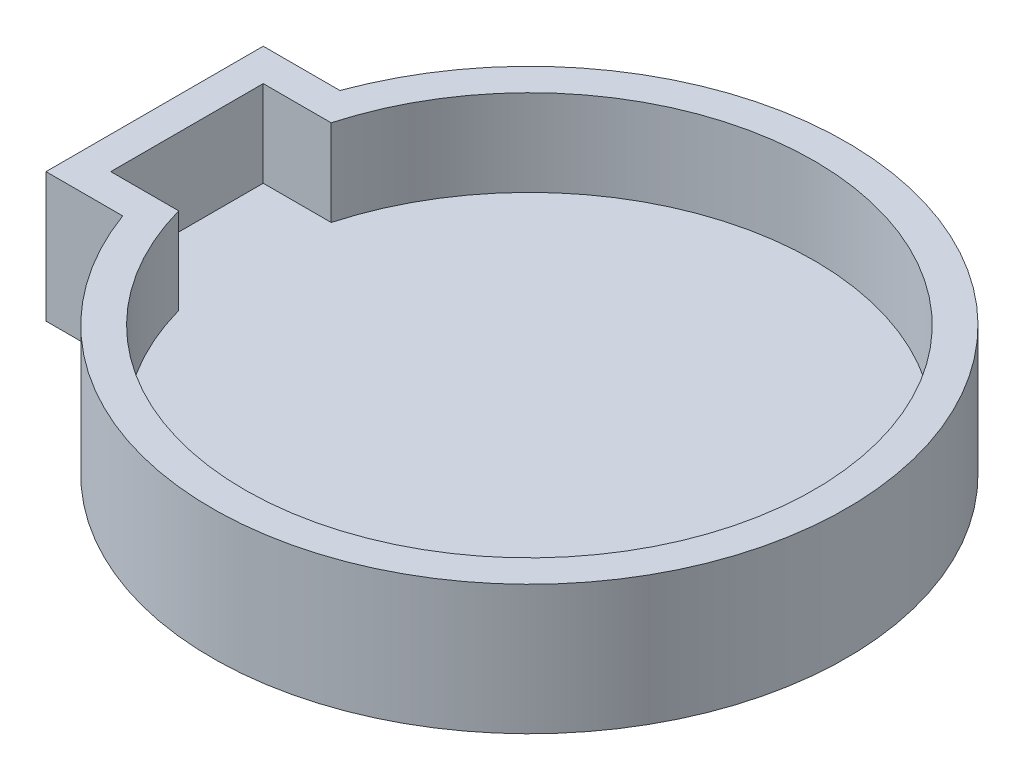
ISO-10303-21;
HEADER;
FILE_DESCRIPTION(('STEP AP214'),'2;1');
FILE_NAME('part.step','',(''),(''),'','','');
FILE_SCHEMA(('AUTOMOTIVE_DESIGN { 1 0 10303 214 1 1 1 1 }'));
ENDSEC;
DATA;
#1=APPLICATION_CONTEXT('core data for automotive mechanical design processes');
#2=APPLICATION_PROTOCOL_DEFINITION('international standard','automotive_design',2000,#1);
#3=PRODUCT_CONTEXT('',#1,'mechanical');
#4=PRODUCT('Part','Part','',(#3));
#5=PRODUCT_RELATED_PRODUCT_CATEGORY('part','',(#4));
#6=PRODUCT_DEFINITION_FORMATION('','',#4);
#7=PRODUCT_DEFINITION_CONTEXT('part definition',#1,'design');
#8=PRODUCT_DEFINITION('design','',#6,#7);
#9=PRODUCT_DEFINITION_SHAPE('','',#8);
#10=(LENGTH_UNIT() NAMED_UNIT(*) SI_UNIT(.MILLI.,.METRE.));
#11=(NAMED_UNIT(*) PLANE_ANGLE_UNIT() SI_UNIT($,.RADIAN.));
#12=(NAMED_UNIT(*) SI_UNIT($,.STERADIAN.) SOLID_ANGLE_UNIT());
#13=UNCERTAINTY_MEASURE_WITH_UNIT(LENGTH_MEASURE(1.E-05),#10,'distance_accuracy_value','');
#14=(GEOMETRIC_REPRESENTATION_CONTEXT(3) GLOBAL_UNCERTAINTY_ASSIGNED_CONTEXT((#13)) GLOBAL_UNIT_ASSIGNED_CONTEXT((#10,
#11,#12)) REPRESENTATION_CONTEXT('',''));
#15=CARTESIAN_POINT('',(0.,0.,0.));
#16=DIRECTION('',(0.,0.,1.));
#17=DIRECTION('',(1.,0.,0.));
#18=AXIS2_PLACEMENT_3D('',#15,#16,#17);
#19=CARTESIAN_POINT('',(-26.05,3.,-7.55));
#20=DIRECTION('',(1.,0.,0.));
#21=DIRECTION('',(0.,0.,-1.));
#22=AXIS2_PLACEMENT_3D('',#19,#20,#21);
#23=PLANE('',#22);
#24=DIRECTION('',(0.,0.,1.));
#25=VECTOR('',#24,1.);
#26=CARTESIAN_POINT('',(-26.05,0.,-7.55));
#27=LINE('',#26,#25);
#28=CARTESIAN_POINT('',(-26.05,0.,-7.55));
#29=VERTEX_POINT('',#28);
#30=CARTESIAN_POINT('',(-26.05,0.,7.55));
#31=VERTEX_POINT('',#30);
#32=EDGE_CURVE('E171',#29,#31,#27,.T.);
#33=ORIENTED_EDGE('',*,*,#32,.T.);
#34=DIRECTION('',(0.,-1.,0.));
#35=VECTOR('',#34,1.);
#36=CARTESIAN_POINT('',(-26.05,3.,7.55));
#37=LINE('',#36,#35);
#38=CARTESIAN_POINT('',(-26.05,9.,7.55));
#39=VERTEX_POINT('',#38);
#40=EDGE_CURVE('E11',#39,#31,#37,.T.);
#41=ORIENTED_EDGE('',*,*,#40,.F.);
#42=DIRECTION('',(0.,0.,1.));
#43=VECTOR('',#42,1.);
#44=CARTESIAN_POINT('',(-26.05,9.,-7.55));
#45=LINE('',#44,#43);
#46=CARTESIAN_POINT('',(-26.05,9.,-7.55));
#47=VERTEX_POINT('',#46);
#48=EDGE_CURVE('E159',#47,#39,#45,.T.);
#49=ORIENTED_EDGE('',*,*,#48,.F.);
#50=DIRECTION('',(0.,-1.,0.));
#51=VECTOR('',#50,1.);
#52=CARTESIAN_POINT('',(-26.05,3.,-7.55));
#53=LINE('',#52,#51);
#54=EDGE_CURVE('E184',#47,#29,#53,.T.);
#55=ORIENTED_EDGE('',*,*,#54,.T.);
#56=EDGE_LOOP('',(#33,#41,#49,#55));
#57=FACE_BOUND('',#56,.T.);
#58=ADVANCED_FACE('F43',(#57),#23,.F.);
#59=CARTESIAN_POINT('',(-26.05,3.,7.55));
#60=DIRECTION('',(0.,0.,-1.));
#61=DIRECTION('',(-1.,0.,0.));
#62=AXIS2_PLACEMENT_3D('',#59,#60,#61);
#63=PLANE('',#62);
#64=DIRECTION('',(1.,0.,0.));
#65=VECTOR('',#64,1.);
#66=CARTESIAN_POINT('',(-26.05,0.,7.55));
#67=LINE('',#66,#65);
#68=CARTESIAN_POINT('',(-20.7171426601257,0.,7.54999999999999));
#69=VERTEX_POINT('',#68);
#70=EDGE_CURVE('E175',#31,#69,#67,.T.);
#71=ORIENTED_EDGE('',*,*,#70,.T.);
#72=DIRECTION('',(0.,-1.,0.));
#73=VECTOR('',#72,1.);
#74=CARTESIAN_POINT('',(-20.7171426601257,3.,7.54999999999999));
#75=LINE('',#74,#73);
#76=CARTESIAN_POINT('',(-20.7171426601257,9.,7.54999999999999));
#77=VERTEX_POINT('',#76);
#78=EDGE_CURVE('E51',#77,#69,#75,.T.);
#79=ORIENTED_EDGE('',*,*,#78,.F.);
#80=DIRECTION('',(1.,0.,0.));
#81=VECTOR('',#80,1.);
#82=CARTESIAN_POINT('',(-26.05,9.,7.55));
#83=LINE('',#82,#81);
#84=EDGE_CURVE('E163',#39,#77,#83,.T.);
#85=ORIENTED_EDGE('',*,*,#84,.F.);
#86=ORIENTED_EDGE('',*,*,#40,.T.);
#87=EDGE_LOOP('',(#71,#79,#85,#86));
#88=FACE_BOUND('',#87,.T.);
#89=ADVANCED_FACE('F209',(#88),#63,.F.);
#90=CARTESIAN_POINT('',(0.,3.,0.));
#91=DIRECTION('',(0.,-1.,0.));
#92=DIRECTION('',(0.,0.,-1.));
#93=AXIS2_PLACEMENT_3D('',#90,#91,#92);
#94=CYLINDRICAL_SURFACE('',#93,22.05);
#95=CARTESIAN_POINT('',(0.,0.,0.));
#96=DIRECTION('',(0.,1.,0.));
#97=DIRECTION('',(0.,0.,1.));
#98=AXIS2_PLACEMENT_3D('',#95,#96,#97);
#99=CIRCLE('',#98,22.05);
#100=CARTESIAN_POINT('',(-20.7171426601257,0.,-7.55));
#101=VERTEX_POINT('',#100);
#102=EDGE_CURVE('E178',#69,#101,#99,.T.);
#103=ORIENTED_EDGE('',*,*,#102,.T.);
#104=DIRECTION('',(0.,-1.,0.));
#105=VECTOR('',#104,1.);
#106=CARTESIAN_POINT('',(-20.7171426601257,3.,-7.55));
#107=LINE('',#106,#105);
#108=CARTESIAN_POINT('',(-20.7171426601257,9.,-7.55));
#109=VERTEX_POINT('',#108);
#110=EDGE_CURVE('E188',#109,#101,#107,.T.);
#111=ORIENTED_EDGE('',*,*,#110,.F.);
#112=CARTESIAN_POINT('',(0.,9.,0.));
#113=DIRECTION('',(0.,1.,0.));
#114=DIRECTION('',(0.,0.,1.));
#115=AXIS2_PLACEMENT_3D('',#112,#113,#114);
#116=CIRCLE('',#115,22.05);
#117=EDGE_CURVE('E167',#77,#109,#116,.T.);
#118=ORIENTED_EDGE('',*,*,#117,.F.);
#119=ORIENTED_EDGE('',*,*,#78,.T.);
#120=EDGE_LOOP('',(#103,#111,#118,#119));
#121=FACE_BOUND('',#120,.T.);
#122=ADVANCED_FACE('F196',(#121),#94,.T.);
#123=CARTESIAN_POINT('',(-26.05,3.,-7.55));
#124=DIRECTION('',(0.,0.,1.));
#125=DIRECTION('',(1.,0.,0.));
#126=AXIS2_PLACEMENT_3D('',#123,#124,#125);
#127=PLANE('',#126);
#128=DIRECTION('',(-1.,0.,0.));
#129=VECTOR('',#128,1.);
#130=CARTESIAN_POINT('',(-26.05,0.,-7.55));
#131=LINE('',#130,#129);
#132=EDGE_CURVE('E181',#101,#29,#131,.T.);
#133=ORIENTED_EDGE('',*,*,#132,.T.);
#134=ORIENTED_EDGE('',*,*,#54,.F.);
#135=DIRECTION('',(-1.,0.,0.));
#136=VECTOR('',#135,1.);
#137=CARTESIAN_POINT('',(-20.7171426601257,9.,-7.55));
#138=LINE('',#137,#136);
#139=EDGE_CURVE('E124',#109,#47,#138,.T.);
#140=ORIENTED_EDGE('',*,*,#139,.F.);
#141=ORIENTED_EDGE('',*,*,#110,.T.);
#142=EDGE_LOOP('',(#133,#134,#140,#141));
#143=FACE_BOUND('',#142,.T.);
#144=ADVANCED_FACE('F204',(#143),#127,.F.);
#145=CARTESIAN_POINT('',(0.,0.,0.));
#146=DIRECTION('',(0.,1.,0.));
#147=DIRECTION('',(0.,0.,1.));
#148=AXIS2_PLACEMENT_3D('',#145,#146,#147);
#149=PLANE('',#148);
#150=ORIENTED_EDGE('',*,*,#32,.F.);
#151=ORIENTED_EDGE('',*,*,#132,.F.);
#152=ORIENTED_EDGE('',*,*,#102,.F.);
#153=ORIENTED_EDGE('',*,*,#70,.F.);
#154=EDGE_LOOP('',(#150,#151,#152,#153));
#155=FACE_BOUND('',#154,.T.);
#156=ADVANCED_FACE('F202',(#155),#149,.F.);
#157=CARTESIAN_POINT('',(0.,9.,0.));
#158=DIRECTION('',(0.,1.,0.));
#159=DIRECTION('',(0.,0.,1.));
#160=AXIS2_PLACEMENT_3D('',#157,#158,#159);
#161=PLANE('',#160);
#162=ORIENTED_EDGE('',*,*,#139,.T.);
#163=ORIENTED_EDGE('',*,*,#48,.T.);
#164=ORIENTED_EDGE('',*,*,#84,.T.);
#165=ORIENTED_EDGE('',*,*,#117,.T.);
#166=EDGE_LOOP('',(#162,#163,#164,#165));
#167=FACE_BOUND('',#166,.T.);
#168=DIRECTION('',(-1.,0.,0.));
#169=VECTOR('',#168,1.);
#170=CARTESIAN_POINT('',(-19.0774736272914,9.,-5.3));
#171=LINE('',#170,#169);
#172=CARTESIAN_POINT('',(-19.0774736272914,9.,-5.3));
#173=VERTEX_POINT('',#172);
#174=CARTESIAN_POINT('',(-23.8,9.,-5.3));
#175=VERTEX_POINT('',#174);
#176=EDGE_CURVE('E117',#173,#175,#171,.T.);
#177=ORIENTED_EDGE('',*,*,#176,.F.);
#178=CARTESIAN_POINT('',(0.,9.,0.));
#179=DIRECTION('',(0.,1.,0.));
#180=DIRECTION('',(0.,0.,1.));
#181=AXIS2_PLACEMENT_3D('',#178,#179,#180);
#182=CIRCLE('',#181,19.8);
#183=CARTESIAN_POINT('',(-19.0774736272914,9.,5.3));
#184=VERTEX_POINT('',#183);
#185=EDGE_CURVE('E107',#184,#173,#182,.T.);
#186=ORIENTED_EDGE('',*,*,#185,.F.);
#187=DIRECTION('',(1.,0.,0.));
#188=VECTOR('',#187,1.);
#189=CARTESIAN_POINT('',(-23.8,9.,5.3));
#190=LINE('',#189,#188);
#191=CARTESIAN_POINT('',(-23.8,9.,5.3));
#192=VERTEX_POINT('',#191);
#193=EDGE_CURVE('E134',#192,#184,#190,.T.);
#194=ORIENTED_EDGE('',*,*,#193,.F.);
#195=DIRECTION('',(0.,0.,1.));
#196=VECTOR('',#195,1.);
#197=CARTESIAN_POINT('',(-23.8,9.,-5.3));
#198=LINE('',#197,#196);
#199=EDGE_CURVE('E130',#175,#192,#198,.T.);
#200=ORIENTED_EDGE('',*,*,#199,.F.);
#201=EDGE_LOOP('',(#177,#186,#194,#200));
#202=FACE_BOUND('',#201,.T.);
#203=ADVANCED_FACE('F128',(#167,#202),#161,.T.);
#204=CARTESIAN_POINT('',(0.,9.,0.));
#205=DIRECTION('',(0.,-1.,0.));
#206=DIRECTION('',(0.,0.,-1.));
#207=AXIS2_PLACEMENT_3D('',#204,#205,#206);
#208=CYLINDRICAL_SURFACE('',#207,19.8);
#209=CARTESIAN_POINT('',(0.,3.,0.));
#210=DIRECTION('',(0.,1.,0.));
#211=DIRECTION('',(0.,0.,1.));
#212=AXIS2_PLACEMENT_3D('',#209,#210,#211);
#213=CIRCLE('',#212,19.8);
#214=CARTESIAN_POINT('',(-19.0774736272914,3.,5.3));
#215=VERTEX_POINT('',#214);
#216=CARTESIAN_POINT('',(-19.0774736272914,3.,-5.3));
#217=VERTEX_POINT('',#216);
#218=EDGE_CURVE('E58',#215,#217,#213,.T.);
#219=ORIENTED_EDGE('',*,*,#218,.F.);
#220=DIRECTION('',(0.,-1.,0.));
#221=VECTOR('',#220,1.);
#222=CARTESIAN_POINT('',(-19.0774736272914,9.,5.3));
#223=LINE('',#222,#221);
#224=EDGE_CURVE('E112',#184,#215,#223,.T.);
#225=ORIENTED_EDGE('',*,*,#224,.F.);
#226=ORIENTED_EDGE('',*,*,#185,.T.);
#227=DIRECTION('',(0.,-1.,0.));
#228=VECTOR('',#227,1.);
#229=CARTESIAN_POINT('',(-19.0774736272914,9.,-5.3));
#230=LINE('',#229,#228);
#231=EDGE_CURVE('E110',#173,#217,#230,.T.);
#232=ORIENTED_EDGE('',*,*,#231,.T.);
#233=EDGE_LOOP('',(#219,#225,#226,#232));
#234=FACE_BOUND('',#233,.T.);
#235=ADVANCED_FACE('F109',(#234),#208,.F.);
#236=CARTESIAN_POINT('',(-19.0774736272914,9.,-5.3));
#237=DIRECTION('',(0.,0.,1.));
#238=DIRECTION('',(1.,0.,0.));
#239=AXIS2_PLACEMENT_3D('',#236,#237,#238);
#240=PLANE('',#239);
#241=DIRECTION('',(-1.,0.,0.));
#242=VECTOR('',#241,1.);
#243=CARTESIAN_POINT('',(-19.0774736272914,3.,-5.3));
#244=LINE('',#243,#242);
#245=CARTESIAN_POINT('',(-23.8,3.,-5.3));
#246=VERTEX_POINT('',#245);
#247=EDGE_CURVE('E62',#217,#246,#244,.T.);
#248=ORIENTED_EDGE('',*,*,#247,.F.);
#249=ORIENTED_EDGE('',*,*,#231,.F.);
#250=ORIENTED_EDGE('',*,*,#176,.T.);
#251=DIRECTION('',(0.,-1.,0.));
#252=VECTOR('',#251,1.);
#253=CARTESIAN_POINT('',(-23.8,9.,-5.3));
#254=LINE('',#253,#252);
#255=EDGE_CURVE('E125',#175,#246,#254,.T.);
#256=ORIENTED_EDGE('',*,*,#255,.T.);
#257=EDGE_LOOP('',(#248,#249,#250,#256));
#258=FACE_BOUND('',#257,.T.);
#259=ADVANCED_FACE('F121',(#258),#240,.T.);
#260=CARTESIAN_POINT('',(-23.8,9.,-5.3));
#261=DIRECTION('',(1.,0.,0.));
#262=DIRECTION('',(0.,0.,-1.));
#263=AXIS2_PLACEMENT_3D('',#260,#261,#262);
#264=PLANE('',#263);
#265=DIRECTION('',(0.,0.,1.));
#266=VECTOR('',#265,1.);
#267=CARTESIAN_POINT('',(-23.8,3.,-5.3));
#268=LINE('',#267,#266);
#269=CARTESIAN_POINT('',(-23.8,3.,5.3));
#270=VERTEX_POINT('',#269);
#271=EDGE_CURVE('E143',#246,#270,#268,.T.);
#272=ORIENTED_EDGE('',*,*,#271,.F.);
#273=ORIENTED_EDGE('',*,*,#255,.F.);
#274=ORIENTED_EDGE('',*,*,#199,.T.);
#275=DIRECTION('',(0.,-1.,0.));
#276=VECTOR('',#275,1.);
#277=CARTESIAN_POINT('',(-23.8,9.,5.3));
#278=LINE('',#277,#276);
#279=EDGE_CURVE('E150',#192,#270,#278,.T.);
#280=ORIENTED_EDGE('',*,*,#279,.T.);
#281=EDGE_LOOP('',(#272,#273,#274,#280));
#282=FACE_BOUND('',#281,.T.);
#283=ADVANCED_FACE('F231',(#282),#264,.T.);
#284=CARTESIAN_POINT('',(-23.8,9.,5.3));
#285=DIRECTION('',(0.,0.,-1.));
#286=DIRECTION('',(-1.,0.,0.));
#287=AXIS2_PLACEMENT_3D('',#284,#285,#286);
#288=PLANE('',#287);
#289=DIRECTION('',(1.,0.,0.));
#290=VECTOR('',#289,1.);
#291=CARTESIAN_POINT('',(-23.8,3.,5.3));
#292=LINE('',#291,#290);
#293=EDGE_CURVE('E118',#270,#215,#292,.T.);
#294=ORIENTED_EDGE('',*,*,#293,.F.);
#295=ORIENTED_EDGE('',*,*,#279,.F.);
#296=ORIENTED_EDGE('',*,*,#193,.T.);
#297=ORIENTED_EDGE('',*,*,#224,.T.);
#298=EDGE_LOOP('',(#294,#295,#296,#297));
#299=FACE_BOUND('',#298,.T.);
#300=ADVANCED_FACE('F224',(#299),#288,.T.);
#301=CARTESIAN_POINT('',(0.,3.,0.));
#302=DIRECTION('',(0.,1.,0.));
#303=DIRECTION('',(0.,0.,1.));
#304=AXIS2_PLACEMENT_3D('',#301,#302,#303);
#305=PLANE('',#304);
#306=ORIENTED_EDGE('',*,*,#218,.T.);
#307=ORIENTED_EDGE('',*,*,#247,.T.);
#308=ORIENTED_EDGE('',*,*,#271,.T.);
#309=ORIENTED_EDGE('',*,*,#293,.T.);
#310=EDGE_LOOP('',(#306,#307,#308,#309));
#311=FACE_BOUND('',#310,.T.);
#312=ADVANCED_FACE('F221',(#311),#305,.T.);
#313=CLOSED_SHELL('',(#58,#89,#122,#144,#156,#203,#235,#259,#283,#300,#312));
#314=MANIFOLD_SOLID_BREP('B2',#313);
#315=ADVANCED_BREP_SHAPE_REPRESENTATION('',(#18,#314),#14);
#316=SHAPE_DEFINITION_REPRESENTATION(#9,#315);
ENDSEC;
END-ISO-10303-21;
